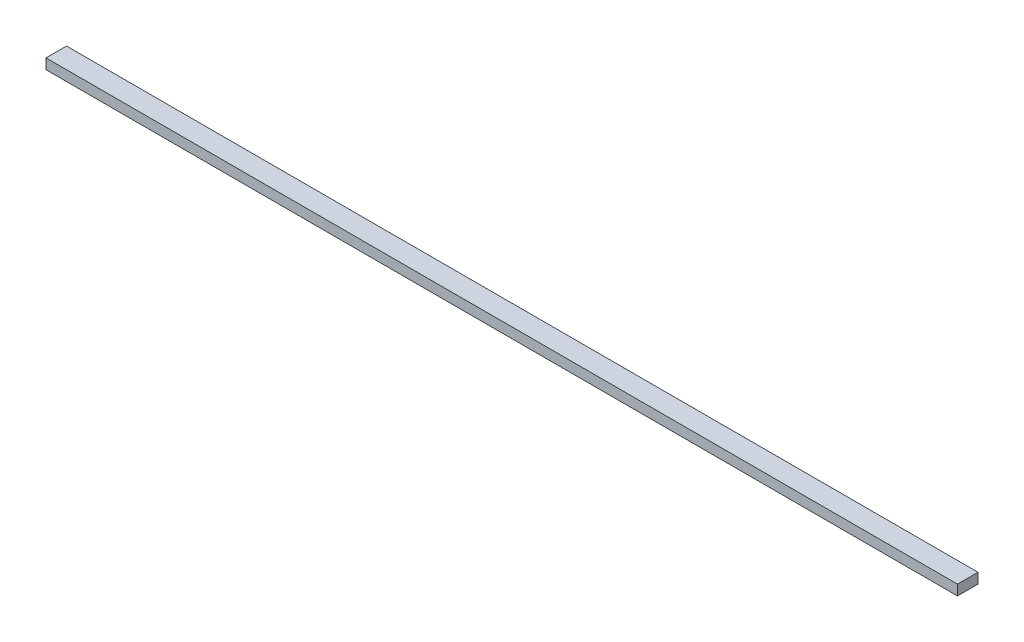
ISO-10303-21;
HEADER;
FILE_DESCRIPTION(('STEP AP214'),'2;1');
FILE_NAME('part.step','',(''),(''),'','','');
FILE_SCHEMA(('AUTOMOTIVE_DESIGN { 1 0 10303 214 1 1 1 1 }'));
ENDSEC;
DATA;
#1=APPLICATION_CONTEXT('core data for automotive mechanical design processes');
#2=APPLICATION_PROTOCOL_DEFINITION('international standard','automotive_design',2000,#1);
#3=PRODUCT_CONTEXT('',#1,'mechanical');
#4=PRODUCT('Part','Part','',(#3));
#5=PRODUCT_RELATED_PRODUCT_CATEGORY('part','',(#4));
#6=PRODUCT_DEFINITION_FORMATION('','',#4);
#7=PRODUCT_DEFINITION_CONTEXT('part definition',#1,'design');
#8=PRODUCT_DEFINITION('design','',#6,#7);
#9=PRODUCT_DEFINITION_SHAPE('','',#8);
#10=(LENGTH_UNIT() NAMED_UNIT(*) SI_UNIT(.MILLI.,.METRE.));
#11=(NAMED_UNIT(*) PLANE_ANGLE_UNIT() SI_UNIT($,.RADIAN.));
#12=(NAMED_UNIT(*) SI_UNIT($,.STERADIAN.) SOLID_ANGLE_UNIT());
#13=UNCERTAINTY_MEASURE_WITH_UNIT(LENGTH_MEASURE(1.E-05),#10,'distance_accuracy_value','');
#14=(GEOMETRIC_REPRESENTATION_CONTEXT(3) GLOBAL_UNCERTAINTY_ASSIGNED_CONTEXT((#13)) GLOBAL_UNIT_ASSIGNED_CONTEXT((#10,
#11,#12)) REPRESENTATION_CONTEXT('',''));
#15=CARTESIAN_POINT('',(0.,0.,0.));
#16=DIRECTION('',(0.,0.,1.));
#17=DIRECTION('',(1.,0.,0.));
#18=AXIS2_PLACEMENT_3D('',#15,#16,#17);
#19=CARTESIAN_POINT('',(-444.265,10.,-9.99999999999998));
#20=DIRECTION('',(1.,0.,0.));
#21=DIRECTION('',(0.,0.,-1.));
#22=AXIS2_PLACEMENT_3D('',#19,#20,#21);
#23=PLANE('',#22);
#24=DIRECTION('',(0.,0.,1.));
#25=VECTOR('',#24,1.);
#26=CARTESIAN_POINT('',(-444.265,0.,-9.99999999999998));
#27=LINE('',#26,#25);
#28=CARTESIAN_POINT('',(-444.265,0.,-9.99999999999998));
#29=VERTEX_POINT('',#28);
#30=CARTESIAN_POINT('',(-444.265,0.,10.));
#31=VERTEX_POINT('',#30);
#32=EDGE_CURVE('E97',#29,#31,#27,.T.);
#33=ORIENTED_EDGE('',*,*,#32,.T.);
#34=DIRECTION('',(0.,-1.,0.));
#35=VECTOR('',#34,1.);
#36=CARTESIAN_POINT('',(-444.265,10.,10.));
#37=LINE('',#36,#35);
#38=CARTESIAN_POINT('',(-444.265,10.,10.));
#39=VERTEX_POINT('',#38);
#40=EDGE_CURVE('E11',#39,#31,#37,.T.);
#41=ORIENTED_EDGE('',*,*,#40,.F.);
#42=DIRECTION('',(0.,0.,1.));
#43=VECTOR('',#42,1.);
#44=CARTESIAN_POINT('',(-444.265,10.,-9.99999999999998));
#45=LINE('',#44,#43);
#46=CARTESIAN_POINT('',(-444.265,10.,-9.99999999999998));
#47=VERTEX_POINT('',#46);
#48=EDGE_CURVE('E85',#47,#39,#45,.T.);
#49=ORIENTED_EDGE('',*,*,#48,.F.);
#50=DIRECTION('',(0.,-1.,0.));
#51=VECTOR('',#50,1.);
#52=CARTESIAN_POINT('',(-444.265,10.,-9.99999999999998));
#53=LINE('',#52,#51);
#54=EDGE_CURVE('E93',#47,#29,#53,.T.);
#55=ORIENTED_EDGE('',*,*,#54,.T.);
#56=EDGE_LOOP('',(#33,#41,#49,#55));
#57=FACE_BOUND('',#56,.T.);
#58=ADVANCED_FACE('F34',(#57),#23,.F.);
#59=CARTESIAN_POINT('',(-444.265,10.,10.));
#60=DIRECTION('',(0.,0.,-1.));
#61=DIRECTION('',(-1.,0.,0.));
#62=AXIS2_PLACEMENT_3D('',#59,#60,#61);
#63=PLANE('',#62);
#64=DIRECTION('',(1.,0.,0.));
#65=VECTOR('',#64,1.);
#66=CARTESIAN_POINT('',(-444.265,0.,10.));
#67=LINE('',#66,#65);
#68=CARTESIAN_POINT('',(444.265,0.,10.));
#69=VERTEX_POINT('',#68);
#70=EDGE_CURVE('E89',#31,#69,#67,.T.);
#71=ORIENTED_EDGE('',*,*,#70,.T.);
#72=DIRECTION('',(0.,-1.,0.));
#73=VECTOR('',#72,1.);
#74=CARTESIAN_POINT('',(444.265,10.,10.));
#75=LINE('',#74,#73);
#76=CARTESIAN_POINT('',(444.265,10.,10.));
#77=VERTEX_POINT('',#76);
#78=EDGE_CURVE('E42',#77,#69,#75,.T.);
#79=ORIENTED_EDGE('',*,*,#78,.F.);
#80=DIRECTION('',(1.,0.,0.));
#81=VECTOR('',#80,1.);
#82=CARTESIAN_POINT('',(-444.265,10.,10.));
#83=LINE('',#82,#81);
#84=EDGE_CURVE('E80',#39,#77,#83,.T.);
#85=ORIENTED_EDGE('',*,*,#84,.F.);
#86=ORIENTED_EDGE('',*,*,#40,.T.);
#87=EDGE_LOOP('',(#71,#79,#85,#86));
#88=FACE_BOUND('',#87,.T.);
#89=ADVANCED_FACE('F88',(#88),#63,.F.);
#90=CARTESIAN_POINT('',(444.265,10.,-9.99999999999995));
#91=DIRECTION('',(-1.,0.,0.));
#92=DIRECTION('',(0.,0.,1.));
#93=AXIS2_PLACEMENT_3D('',#90,#91,#92);
#94=PLANE('',#93);
#95=DIRECTION('',(0.,0.,-1.));
#96=VECTOR('',#95,1.);
#97=CARTESIAN_POINT('',(444.265,0.,-9.99999999999995));
#98=LINE('',#97,#96);
#99=CARTESIAN_POINT('',(444.265,0.,-9.99999999999995));
#100=VERTEX_POINT('',#99);
#101=EDGE_CURVE('E67',#69,#100,#98,.T.);
#102=ORIENTED_EDGE('',*,*,#101,.T.);
#103=DIRECTION('',(0.,-1.,0.));
#104=VECTOR('',#103,1.);
#105=CARTESIAN_POINT('',(444.265,10.,-9.99999999999995));
#106=LINE('',#105,#104);
#107=CARTESIAN_POINT('',(444.265,10.,-9.99999999999995));
#108=VERTEX_POINT('',#107);
#109=EDGE_CURVE('E90',#108,#100,#106,.T.);
#110=ORIENTED_EDGE('',*,*,#109,.F.);
#111=DIRECTION('',(0.,0.,-1.));
#112=VECTOR('',#111,1.);
#113=CARTESIAN_POINT('',(444.265,10.,-9.99999999999995));
#114=LINE('',#113,#112);
#115=EDGE_CURVE('E83',#77,#108,#114,.T.);
#116=ORIENTED_EDGE('',*,*,#115,.F.);
#117=ORIENTED_EDGE('',*,*,#78,.T.);
#118=EDGE_LOOP('',(#102,#110,#116,#117));
#119=FACE_BOUND('',#118,.T.);
#120=ADVANCED_FACE('F91',(#119),#94,.F.);
#121=CARTESIAN_POINT('',(-444.265,10.,-9.99999999999998));
#122=DIRECTION('',(0.,0.,1.));
#123=DIRECTION('',(1.,0.,0.));
#124=AXIS2_PLACEMENT_3D('',#121,#122,#123);
#125=PLANE('',#124);
#126=DIRECTION('',(-1.,0.,0.));
#127=VECTOR('',#126,1.);
#128=CARTESIAN_POINT('',(-444.265,0.,-9.99999999999998));
#129=LINE('',#128,#127);
#130=EDGE_CURVE('E73',#100,#29,#129,.T.);
#131=ORIENTED_EDGE('',*,*,#130,.T.);
#132=ORIENTED_EDGE('',*,*,#54,.F.);
#133=DIRECTION('',(-1.,0.,0.));
#134=VECTOR('',#133,1.);
#135=CARTESIAN_POINT('',(-444.265,10.,-9.99999999999998));
#136=LINE('',#135,#134);
#137=EDGE_CURVE('E50',#108,#47,#136,.T.);
#138=ORIENTED_EDGE('',*,*,#137,.F.);
#139=ORIENTED_EDGE('',*,*,#109,.T.);
#140=EDGE_LOOP('',(#131,#132,#138,#139));
#141=FACE_BOUND('',#140,.T.);
#142=ADVANCED_FACE('F104',(#141),#125,.F.);
#143=CARTESIAN_POINT('',(0.,10.,0.));
#144=DIRECTION('',(0.,1.,0.));
#145=DIRECTION('',(0.,0.,1.));
#146=AXIS2_PLACEMENT_3D('',#143,#144,#145);
#147=PLANE('',#146);
#148=ORIENTED_EDGE('',*,*,#48,.T.);
#149=ORIENTED_EDGE('',*,*,#84,.T.);
#150=ORIENTED_EDGE('',*,*,#115,.T.);
#151=ORIENTED_EDGE('',*,*,#137,.T.);
#152=EDGE_LOOP('',(#148,#149,#150,#151));
#153=FACE_BOUND('',#152,.T.);
#154=ADVANCED_FACE('F81',(#153),#147,.T.);
#155=CARTESIAN_POINT('',(0.,0.,0.));
#156=DIRECTION('',(0.,1.,0.));
#157=DIRECTION('',(0.,0.,1.));
#158=AXIS2_PLACEMENT_3D('',#155,#156,#157);
#159=PLANE('',#158);
#160=ORIENTED_EDGE('',*,*,#32,.F.);
#161=ORIENTED_EDGE('',*,*,#130,.F.);
#162=ORIENTED_EDGE('',*,*,#101,.F.);
#163=ORIENTED_EDGE('',*,*,#70,.F.);
#164=EDGE_LOOP('',(#160,#161,#162,#163));
#165=FACE_BOUND('',#164,.T.);
#166=ADVANCED_FACE('F107',(#165),#159,.F.);
#167=CLOSED_SHELL('',(#58,#89,#120,#142,#154,#166));
#168=MANIFOLD_SOLID_BREP('B2',#167);
#169=ADVANCED_BREP_SHAPE_REPRESENTATION('',(#18,#168),#14);
#170=SHAPE_DEFINITION_REPRESENTATION(#9,#169);
ENDSEC;
END-ISO-10303-21;
